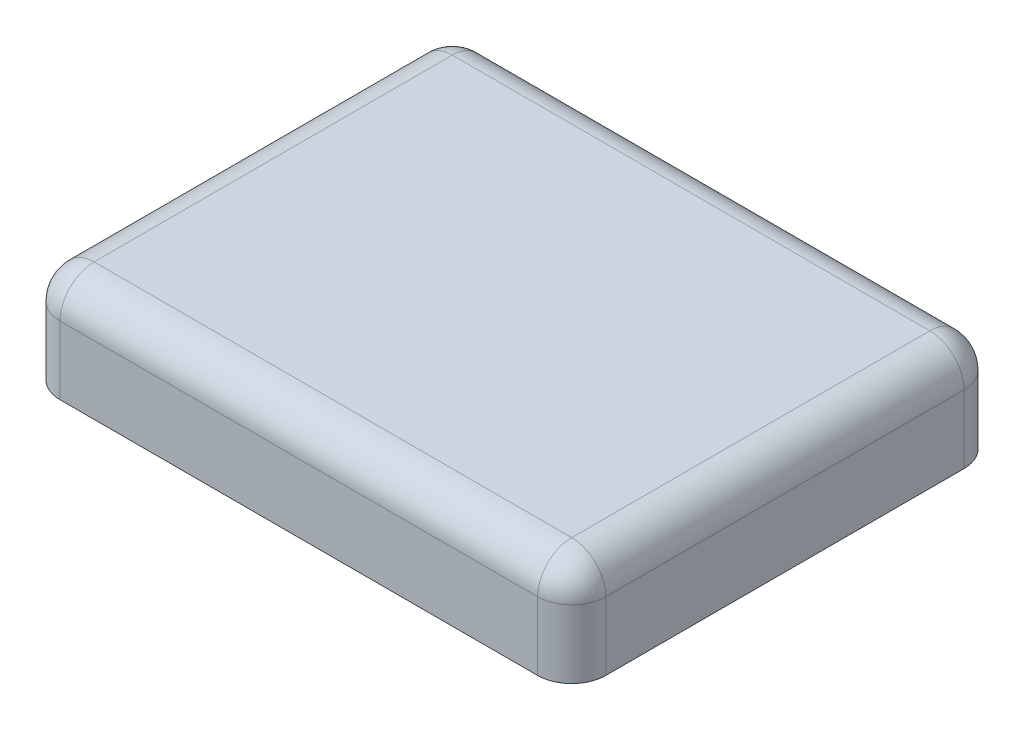
ISO-10303-21;
HEADER;
FILE_DESCRIPTION(('STEP AP214'),'2;1');
FILE_NAME('part.step','',(''),(''),'','','');
FILE_SCHEMA(('AUTOMOTIVE_DESIGN { 1 0 10303 214 1 1 1 1 }'));
ENDSEC;
DATA;
#1=APPLICATION_CONTEXT('core data for automotive mechanical design processes');
#2=APPLICATION_PROTOCOL_DEFINITION('international standard','automotive_design',2000,#1);
#3=PRODUCT_CONTEXT('',#1,'mechanical');
#4=PRODUCT('Part','Part','',(#3));
#5=PRODUCT_RELATED_PRODUCT_CATEGORY('part','',(#4));
#6=PRODUCT_DEFINITION_FORMATION('','',#4);
#7=PRODUCT_DEFINITION_CONTEXT('part definition',#1,'design');
#8=PRODUCT_DEFINITION('design','',#6,#7);
#9=PRODUCT_DEFINITION_SHAPE('','',#8);
#10=(LENGTH_UNIT() NAMED_UNIT(*) SI_UNIT(.MILLI.,.METRE.));
#11=(NAMED_UNIT(*) PLANE_ANGLE_UNIT() SI_UNIT($,.RADIAN.));
#12=(NAMED_UNIT(*) SI_UNIT($,.STERADIAN.) SOLID_ANGLE_UNIT());
#13=UNCERTAINTY_MEASURE_WITH_UNIT(LENGTH_MEASURE(1.E-05),#10,'distance_accuracy_value','');
#14=(GEOMETRIC_REPRESENTATION_CONTEXT(3) GLOBAL_UNCERTAINTY_ASSIGNED_CONTEXT((#13)) GLOBAL_UNIT_ASSIGNED_CONTEXT((#10,
#11,#12)) REPRESENTATION_CONTEXT('',''));
#15=CARTESIAN_POINT('',(0.,0.,0.));
#16=DIRECTION('',(0.,0.,1.));
#17=DIRECTION('',(1.,0.,0.));
#18=AXIS2_PLACEMENT_3D('',#15,#16,#17);
#19=CARTESIAN_POINT('',(1.6,0.6,-1.25));
#20=DIRECTION('',(-1.,0.,0.));
#21=DIRECTION('',(0.,0.,1.));
#22=AXIS2_PLACEMENT_3D('',#19,#20,#21);
#23=PLANE('',#22);
#24=DIRECTION('',(0.,-1.,0.));
#25=VECTOR('',#24,1.);
#26=CARTESIAN_POINT('',(1.6,0.6,-1.05));
#27=LINE('',#26,#25);
#28=CARTESIAN_POINT('',(1.6,0.,-1.05));
#29=VERTEX_POINT('',#28);
#30=CARTESIAN_POINT('',(1.6,0.4,-1.05));
#31=VERTEX_POINT('',#30);
#32=EDGE_CURVE('E120',#29,#31,#27,.F.);
#33=ORIENTED_EDGE('',*,*,#32,.T.);
#34=DIRECTION('',(0.,0.,-1.));
#35=VECTOR('',#34,1.);
#36=CARTESIAN_POINT('',(1.6,0.4,1.05));
#37=LINE('',#36,#35);
#38=CARTESIAN_POINT('',(1.6,0.4,1.05));
#39=VERTEX_POINT('',#38);
#40=EDGE_CURVE('E60',#31,#39,#37,.F.);
#41=ORIENTED_EDGE('',*,*,#40,.T.);
#42=DIRECTION('',(0.,-1.,0.));
#43=VECTOR('',#42,1.);
#44=CARTESIAN_POINT('',(1.6,0.6,1.05));
#45=LINE('',#44,#43);
#46=CARTESIAN_POINT('',(1.6,0.,1.05));
#47=VERTEX_POINT('',#46);
#48=EDGE_CURVE('E113',#39,#47,#45,.T.);
#49=ORIENTED_EDGE('',*,*,#48,.T.);
#50=DIRECTION('',(0.,0.,-1.));
#51=VECTOR('',#50,1.);
#52=CARTESIAN_POINT('',(1.6,0.,-1.25));
#53=LINE('',#52,#51);
#54=EDGE_CURVE('E116',#47,#29,#53,.T.);
#55=ORIENTED_EDGE('',*,*,#54,.T.);
#56=EDGE_LOOP('',(#33,#41,#49,#55));
#57=FACE_BOUND('',#56,.T.);
#58=ADVANCED_FACE('F36',(#57),#23,.F.);
#59=CARTESIAN_POINT('',(-1.6,0.6,-1.25));
#60=DIRECTION('',(0.,0.,1.));
#61=DIRECTION('',(1.,0.,0.));
#62=AXIS2_PLACEMENT_3D('',#59,#60,#61);
#63=PLANE('',#62);
#64=DIRECTION('',(0.,-1.,0.));
#65=VECTOR('',#64,1.);
#66=CARTESIAN_POINT('',(-1.4,0.6,-1.25));
#67=LINE('',#66,#65);
#68=CARTESIAN_POINT('',(-1.4,0.,-1.25));
#69=VERTEX_POINT('',#68);
#70=CARTESIAN_POINT('',(-1.4,0.4,-1.25));
#71=VERTEX_POINT('',#70);
#72=EDGE_CURVE('E153',#69,#71,#67,.F.);
#73=ORIENTED_EDGE('',*,*,#72,.T.);
#74=DIRECTION('',(-1.,0.,0.));
#75=VECTOR('',#74,1.);
#76=CARTESIAN_POINT('',(1.4,0.4,-1.25));
#77=LINE('',#76,#75);
#78=CARTESIAN_POINT('',(1.4,0.4,-1.25));
#79=VERTEX_POINT('',#78);
#80=EDGE_CURVE('E179',#71,#79,#77,.F.);
#81=ORIENTED_EDGE('',*,*,#80,.T.);
#82=DIRECTION('',(0.,-1.,0.));
#83=VECTOR('',#82,1.);
#84=CARTESIAN_POINT('',(1.4,0.6,-1.25));
#85=LINE('',#84,#83);
#86=CARTESIAN_POINT('',(1.4,0.,-1.25));
#87=VERTEX_POINT('',#86);
#88=EDGE_CURVE('E156',#79,#87,#85,.T.);
#89=ORIENTED_EDGE('',*,*,#88,.T.);
#90=DIRECTION('',(-1.,0.,0.));
#91=VECTOR('',#90,1.);
#92=CARTESIAN_POINT('',(-1.6,0.,-1.25));
#93=LINE('',#92,#91);
#94=EDGE_CURVE('E134',#87,#69,#93,.T.);
#95=ORIENTED_EDGE('',*,*,#94,.T.);
#96=EDGE_LOOP('',(#73,#81,#89,#95));
#97=FACE_BOUND('',#96,.T.);
#98=ADVANCED_FACE('F238',(#97),#63,.F.);
#99=CARTESIAN_POINT('',(-1.6,0.6,-1.25));
#100=DIRECTION('',(1.,0.,0.));
#101=DIRECTION('',(0.,0.,-1.));
#102=AXIS2_PLACEMENT_3D('',#99,#100,#101);
#103=PLANE('',#102);
#104=DIRECTION('',(0.,-1.,0.));
#105=VECTOR('',#104,1.);
#106=CARTESIAN_POINT('',(-1.6,0.6,1.05));
#107=LINE('',#106,#105);
#108=CARTESIAN_POINT('',(-1.6,0.,1.05));
#109=VERTEX_POINT('',#108);
#110=CARTESIAN_POINT('',(-1.6,0.4,1.05));
#111=VERTEX_POINT('',#110);
#112=EDGE_CURVE('E160',#109,#111,#107,.F.);
#113=ORIENTED_EDGE('',*,*,#112,.T.);
#114=DIRECTION('',(0.,0.,1.));
#115=VECTOR('',#114,1.);
#116=CARTESIAN_POINT('',(-1.6,0.4,-1.05));
#117=LINE('',#116,#115);
#118=CARTESIAN_POINT('',(-1.6,0.4,-1.05));
#119=VERTEX_POINT('',#118);
#120=EDGE_CURVE('E175',#111,#119,#117,.F.);
#121=ORIENTED_EDGE('',*,*,#120,.T.);
#122=DIRECTION('',(0.,-1.,0.));
#123=VECTOR('',#122,1.);
#124=CARTESIAN_POINT('',(-1.6,0.6,-1.05));
#125=LINE('',#124,#123);
#126=CARTESIAN_POINT('',(-1.6,0.,-1.05));
#127=VERTEX_POINT('',#126);
#128=EDGE_CURVE('E158',#119,#127,#125,.T.);
#129=ORIENTED_EDGE('',*,*,#128,.T.);
#130=DIRECTION('',(0.,0.,1.));
#131=VECTOR('',#130,1.);
#132=CARTESIAN_POINT('',(-1.6,0.,-1.25));
#133=LINE('',#132,#131);
#134=EDGE_CURVE('E137',#127,#109,#133,.T.);
#135=ORIENTED_EDGE('',*,*,#134,.T.);
#136=EDGE_LOOP('',(#113,#121,#129,#135));
#137=FACE_BOUND('',#136,.T.);
#138=ADVANCED_FACE('F243',(#137),#103,.F.);
#139=CARTESIAN_POINT('',(-1.6,0.6,1.25));
#140=DIRECTION('',(0.,0.,-1.));
#141=DIRECTION('',(-1.,0.,0.));
#142=AXIS2_PLACEMENT_3D('',#139,#140,#141);
#143=PLANE('',#142);
#144=DIRECTION('',(0.,-1.,0.));
#145=VECTOR('',#144,1.);
#146=CARTESIAN_POINT('',(1.4,0.6,1.25));
#147=LINE('',#146,#145);
#148=CARTESIAN_POINT('',(1.4,0.,1.25));
#149=VERTEX_POINT('',#148);
#150=CARTESIAN_POINT('',(1.4,0.4,1.25));
#151=VERTEX_POINT('',#150);
#152=EDGE_CURVE('E124',#149,#151,#147,.F.);
#153=ORIENTED_EDGE('',*,*,#152,.T.);
#154=DIRECTION('',(1.,0.,0.));
#155=VECTOR('',#154,1.);
#156=CARTESIAN_POINT('',(-1.4,0.4,1.25));
#157=LINE('',#156,#155);
#158=CARTESIAN_POINT('',(-1.4,0.4,1.25));
#159=VERTEX_POINT('',#158);
#160=EDGE_CURVE('E11',#151,#159,#157,.F.);
#161=ORIENTED_EDGE('',*,*,#160,.T.);
#162=DIRECTION('',(0.,-1.,0.));
#163=VECTOR('',#162,1.);
#164=CARTESIAN_POINT('',(-1.4,0.6,1.25));
#165=LINE('',#164,#163);
#166=CARTESIAN_POINT('',(-1.4,0.,1.25));
#167=VERTEX_POINT('',#166);
#168=EDGE_CURVE('E128',#159,#167,#165,.T.);
#169=ORIENTED_EDGE('',*,*,#168,.T.);
#170=DIRECTION('',(1.,0.,0.));
#171=VECTOR('',#170,1.);
#172=CARTESIAN_POINT('',(-1.6,0.,1.25));
#173=LINE('',#172,#171);
#174=EDGE_CURVE('E144',#167,#149,#173,.T.);
#175=ORIENTED_EDGE('',*,*,#174,.T.);
#176=EDGE_LOOP('',(#153,#161,#169,#175));
#177=FACE_BOUND('',#176,.T.);
#178=ADVANCED_FACE('F354',(#177),#143,.F.);
#179=CARTESIAN_POINT('',(0.,0.6,0.));
#180=DIRECTION('',(0.,1.,0.));
#181=DIRECTION('',(0.,0.,1.));
#182=AXIS2_PLACEMENT_3D('',#179,#180,#181);
#183=PLANE('',#182);
#184=DIRECTION('',(-1.,0.,0.));
#185=VECTOR('',#184,1.);
#186=CARTESIAN_POINT('',(-1.4,0.6,-1.05));
#187=LINE('',#186,#185);
#188=CARTESIAN_POINT('',(1.4,0.6,-1.05));
#189=VERTEX_POINT('',#188);
#190=CARTESIAN_POINT('',(-1.4,0.6,-1.05));
#191=VERTEX_POINT('',#190);
#192=EDGE_CURVE('E170',#189,#191,#187,.T.);
#193=ORIENTED_EDGE('',*,*,#192,.T.);
#194=DIRECTION('',(0.,0.,1.));
#195=VECTOR('',#194,1.);
#196=CARTESIAN_POINT('',(-1.4,0.6,1.05));
#197=LINE('',#196,#195);
#198=CARTESIAN_POINT('',(-1.4,0.6,1.05));
#199=VERTEX_POINT('',#198);
#200=EDGE_CURVE('E172',#191,#199,#197,.T.);
#201=ORIENTED_EDGE('',*,*,#200,.T.);
#202=DIRECTION('',(1.,0.,0.));
#203=VECTOR('',#202,1.);
#204=CARTESIAN_POINT('',(1.4,0.6,1.05));
#205=LINE('',#204,#203);
#206=CARTESIAN_POINT('',(1.4,0.6,1.05));
#207=VERTEX_POINT('',#206);
#208=EDGE_CURVE('E166',#199,#207,#205,.T.);
#209=ORIENTED_EDGE('',*,*,#208,.T.);
#210=DIRECTION('',(0.,0.,-1.));
#211=VECTOR('',#210,1.);
#212=CARTESIAN_POINT('',(1.4,0.6,-1.05));
#213=LINE('',#212,#211);
#214=EDGE_CURVE('E168',#207,#189,#213,.T.);
#215=ORIENTED_EDGE('',*,*,#214,.T.);
#216=EDGE_LOOP('',(#193,#201,#209,#215));
#217=FACE_BOUND('',#216,.T.);
#218=ADVANCED_FACE('F215',(#217),#183,.T.);
#219=CARTESIAN_POINT('',(0.,0.,0.));
#220=DIRECTION('',(0.,1.,0.));
#221=DIRECTION('',(0.,0.,1.));
#222=AXIS2_PLACEMENT_3D('',#219,#220,#221);
#223=PLANE('',#222);
#224=ORIENTED_EDGE('',*,*,#54,.F.);
#225=CARTESIAN_POINT('',(1.4,0.,1.05));
#226=DIRECTION('',(0.,1.,0.));
#227=DIRECTION('',(0.,0.,1.));
#228=AXIS2_PLACEMENT_3D('',#225,#226,#227);
#229=CIRCLE('',#228,0.2);
#230=EDGE_CURVE('E122',#47,#149,#229,.F.);
#231=ORIENTED_EDGE('',*,*,#230,.T.);
#232=ORIENTED_EDGE('',*,*,#174,.F.);
#233=CARTESIAN_POINT('',(-1.4,0.,1.05));
#234=DIRECTION('',(0.,1.,0.));
#235=DIRECTION('',(0.,0.,1.));
#236=AXIS2_PLACEMENT_3D('',#233,#234,#235);
#237=CIRCLE('',#236,0.2);
#238=EDGE_CURVE('E148',#167,#109,#237,.F.);
#239=ORIENTED_EDGE('',*,*,#238,.T.);
#240=ORIENTED_EDGE('',*,*,#134,.F.);
#241=CARTESIAN_POINT('',(-1.4,0.,-1.05));
#242=DIRECTION('',(0.,1.,0.));
#243=DIRECTION('',(0.,0.,1.));
#244=AXIS2_PLACEMENT_3D('',#241,#242,#243);
#245=CIRCLE('',#244,0.2);
#246=EDGE_CURVE('E119',#127,#69,#245,.F.);
#247=ORIENTED_EDGE('',*,*,#246,.T.);
#248=ORIENTED_EDGE('',*,*,#94,.F.);
#249=CARTESIAN_POINT('',(1.4,0.,-1.05));
#250=DIRECTION('',(0.,1.,0.));
#251=DIRECTION('',(0.,0.,1.));
#252=AXIS2_PLACEMENT_3D('',#249,#250,#251);
#253=CIRCLE('',#252,0.2);
#254=EDGE_CURVE('E129',#87,#29,#253,.F.);
#255=ORIENTED_EDGE('',*,*,#254,.T.);
#256=EDGE_LOOP('',(#224,#231,#232,#239,#240,#247,#248,#255));
#257=FACE_BOUND('',#256,.T.);
#258=ADVANCED_FACE('F131',(#257),#223,.F.);
#259=CARTESIAN_POINT('',(1.4,0.6,1.05));
#260=DIRECTION('',(0.,-1.,0.));
#261=DIRECTION('',(0.,0.,-1.));
#262=AXIS2_PLACEMENT_3D('',#259,#260,#261);
#263=CYLINDRICAL_SURFACE('',#262,0.2);
#264=ORIENTED_EDGE('',*,*,#48,.F.);
#265=CARTESIAN_POINT('',(1.4,0.4,1.05));
#266=DIRECTION('',(0.,-1.,0.));
#267=DIRECTION('',(0.,0.,-1.));
#268=AXIS2_PLACEMENT_3D('',#265,#266,#267);
#269=CIRCLE('',#268,0.2);
#270=EDGE_CURVE('E45',#39,#151,#269,.T.);
#271=ORIENTED_EDGE('',*,*,#270,.T.);
#272=ORIENTED_EDGE('',*,*,#152,.F.);
#273=ORIENTED_EDGE('',*,*,#230,.F.);
#274=EDGE_LOOP('',(#264,#271,#272,#273));
#275=FACE_BOUND('',#274,.T.);
#276=ADVANCED_FACE('F123',(#275),#263,.T.);
#277=CARTESIAN_POINT('',(1.4,0.6,-1.05));
#278=DIRECTION('',(0.,-1.,0.));
#279=DIRECTION('',(0.,0.,-1.));
#280=AXIS2_PLACEMENT_3D('',#277,#278,#279);
#281=CYLINDRICAL_SURFACE('',#280,0.2);
#282=ORIENTED_EDGE('',*,*,#88,.F.);
#283=CARTESIAN_POINT('',(1.4,0.4,-1.05));
#284=DIRECTION('',(0.,-1.,0.));
#285=DIRECTION('',(0.,0.,-1.));
#286=AXIS2_PLACEMENT_3D('',#283,#284,#285);
#287=CIRCLE('',#286,0.2);
#288=EDGE_CURVE('E181',#79,#31,#287,.T.);
#289=ORIENTED_EDGE('',*,*,#288,.T.);
#290=ORIENTED_EDGE('',*,*,#32,.F.);
#291=ORIENTED_EDGE('',*,*,#254,.F.);
#292=EDGE_LOOP('',(#282,#289,#290,#291));
#293=FACE_BOUND('',#292,.T.);
#294=ADVANCED_FACE('F250',(#293),#281,.T.);
#295=CARTESIAN_POINT('',(-1.4,0.6,1.05));
#296=DIRECTION('',(0.,-1.,0.));
#297=DIRECTION('',(0.,0.,-1.));
#298=AXIS2_PLACEMENT_3D('',#295,#296,#297);
#299=CYLINDRICAL_SURFACE('',#298,0.2);
#300=ORIENTED_EDGE('',*,*,#168,.F.);
#301=CARTESIAN_POINT('',(-1.4,0.4,1.05));
#302=DIRECTION('',(0.,-1.,0.));
#303=DIRECTION('',(0.,0.,-1.));
#304=AXIS2_PLACEMENT_3D('',#301,#302,#303);
#305=CIRCLE('',#304,0.2);
#306=EDGE_CURVE('E163',#159,#111,#305,.T.);
#307=ORIENTED_EDGE('',*,*,#306,.T.);
#308=ORIENTED_EDGE('',*,*,#112,.F.);
#309=ORIENTED_EDGE('',*,*,#238,.F.);
#310=EDGE_LOOP('',(#300,#307,#308,#309));
#311=FACE_BOUND('',#310,.T.);
#312=ADVANCED_FACE('F253',(#311),#299,.T.);
#313=CARTESIAN_POINT('',(-1.4,0.6,-1.05));
#314=DIRECTION('',(0.,-1.,0.));
#315=DIRECTION('',(0.,0.,-1.));
#316=AXIS2_PLACEMENT_3D('',#313,#314,#315);
#317=CYLINDRICAL_SURFACE('',#316,0.2);
#318=ORIENTED_EDGE('',*,*,#128,.F.);
#319=CARTESIAN_POINT('',(-1.4,0.4,-1.05));
#320=DIRECTION('',(0.,-1.,0.));
#321=DIRECTION('',(0.,0.,-1.));
#322=AXIS2_PLACEMENT_3D('',#319,#320,#321);
#323=CIRCLE('',#322,0.2);
#324=EDGE_CURVE('E177',#119,#71,#323,.T.);
#325=ORIENTED_EDGE('',*,*,#324,.T.);
#326=ORIENTED_EDGE('',*,*,#72,.F.);
#327=ORIENTED_EDGE('',*,*,#246,.F.);
#328=EDGE_LOOP('',(#318,#325,#326,#327));
#329=FACE_BOUND('',#328,.T.);
#330=ADVANCED_FACE('F257',(#329),#317,.T.);
#331=CARTESIAN_POINT('',(1.4,0.4,-1.05));
#332=DIRECTION('',(0.,1.,0.));
#333=DIRECTION('',(0.,0.,1.));
#334=AXIS2_PLACEMENT_3D('',#331,#332,#333);
#335=SPHERICAL_SURFACE('',#334,0.2);
#336=CARTESIAN_POINT('',(1.4,0.4,-1.05));
#337=DIRECTION('',(0.,0.,1.));
#338=DIRECTION('',(1.,0.,0.));
#339=AXIS2_PLACEMENT_3D('',#336,#337,#338);
#340=CIRCLE('',#339,0.2);
#341=EDGE_CURVE('E140',#31,#189,#340,.T.);
#342=ORIENTED_EDGE('',*,*,#341,.F.);
#343=ORIENTED_EDGE('',*,*,#288,.F.);
#344=CARTESIAN_POINT('',(1.4,0.4,-1.05));
#345=DIRECTION('',(-1.,0.,0.));
#346=DIRECTION('',(0.,0.,1.));
#347=AXIS2_PLACEMENT_3D('',#344,#345,#346);
#348=CIRCLE('',#347,0.2);
#349=EDGE_CURVE('E40',#189,#79,#348,.T.);
#350=ORIENTED_EDGE('',*,*,#349,.F.);
#351=EDGE_LOOP('',(#342,#343,#350));
#352=FACE_BOUND('',#351,.T.);
#353=ADVANCED_FACE('F38',(#352),#335,.T.);
#354=CARTESIAN_POINT('',(0.,0.4,-1.05));
#355=DIRECTION('',(1.,0.,0.));
#356=DIRECTION('',(0.,0.,-1.));
#357=AXIS2_PLACEMENT_3D('',#354,#355,#356);
#358=CYLINDRICAL_SURFACE('',#357,0.2);
#359=ORIENTED_EDGE('',*,*,#349,.T.);
#360=ORIENTED_EDGE('',*,*,#80,.F.);
#361=CARTESIAN_POINT('',(-1.4,0.4,-1.05));
#362=DIRECTION('',(-1.,0.,0.));
#363=DIRECTION('',(0.,0.,1.));
#364=AXIS2_PLACEMENT_3D('',#361,#362,#363);
#365=CIRCLE('',#364,0.2);
#366=EDGE_CURVE('E198',#191,#71,#365,.T.);
#367=ORIENTED_EDGE('',*,*,#366,.F.);
#368=ORIENTED_EDGE('',*,*,#192,.F.);
#369=EDGE_LOOP('',(#359,#360,#367,#368));
#370=FACE_BOUND('',#369,.T.);
#371=ADVANCED_FACE('F212',(#370),#358,.T.);
#372=CARTESIAN_POINT('',(1.4,0.4,0.));
#373=DIRECTION('',(0.,0.,1.));
#374=DIRECTION('',(1.,0.,0.));
#375=AXIS2_PLACEMENT_3D('',#372,#373,#374);
#376=CYLINDRICAL_SURFACE('',#375,0.2);
#377=ORIENTED_EDGE('',*,*,#341,.T.);
#378=ORIENTED_EDGE('',*,*,#214,.F.);
#379=CARTESIAN_POINT('',(1.4,0.4,1.05));
#380=DIRECTION('',(0.,0.,1.));
#381=DIRECTION('',(1.,0.,0.));
#382=AXIS2_PLACEMENT_3D('',#379,#380,#381);
#383=CIRCLE('',#382,0.2);
#384=EDGE_CURVE('E195',#39,#207,#383,.T.);
#385=ORIENTED_EDGE('',*,*,#384,.F.);
#386=ORIENTED_EDGE('',*,*,#40,.F.);
#387=EDGE_LOOP('',(#377,#378,#385,#386));
#388=FACE_BOUND('',#387,.T.);
#389=ADVANCED_FACE('F205',(#388),#376,.T.);
#390=CARTESIAN_POINT('',(-1.4,0.4,-1.05));
#391=DIRECTION('',(0.,1.,0.));
#392=DIRECTION('',(0.,0.,1.));
#393=AXIS2_PLACEMENT_3D('',#390,#391,#392);
#394=SPHERICAL_SURFACE('',#393,0.2);
#395=ORIENTED_EDGE('',*,*,#366,.T.);
#396=ORIENTED_EDGE('',*,*,#324,.F.);
#397=CARTESIAN_POINT('',(-1.4,0.4,-1.05));
#398=DIRECTION('',(0.,0.,1.));
#399=DIRECTION('',(1.,0.,0.));
#400=AXIS2_PLACEMENT_3D('',#397,#398,#399);
#401=CIRCLE('',#400,0.2);
#402=EDGE_CURVE('E192',#191,#119,#401,.T.);
#403=ORIENTED_EDGE('',*,*,#402,.F.);
#404=EDGE_LOOP('',(#395,#396,#403));
#405=FACE_BOUND('',#404,.T.);
#406=ADVANCED_FACE('F227',(#405),#394,.T.);
#407=CARTESIAN_POINT('',(1.4,0.4,1.05));
#408=DIRECTION('',(0.,1.,0.));
#409=DIRECTION('',(0.,0.,1.));
#410=AXIS2_PLACEMENT_3D('',#407,#408,#409);
#411=SPHERICAL_SURFACE('',#410,0.2);
#412=ORIENTED_EDGE('',*,*,#270,.F.);
#413=ORIENTED_EDGE('',*,*,#384,.T.);
#414=CARTESIAN_POINT('',(1.4,0.4,1.05));
#415=DIRECTION('',(-1.,0.,0.));
#416=DIRECTION('',(0.,0.,1.));
#417=AXIS2_PLACEMENT_3D('',#414,#415,#416);
#418=CIRCLE('',#417,0.2);
#419=EDGE_CURVE('E189',#151,#207,#418,.T.);
#420=ORIENTED_EDGE('',*,*,#419,.F.);
#421=EDGE_LOOP('',(#412,#413,#420));
#422=FACE_BOUND('',#421,.T.);
#423=ADVANCED_FACE('F224',(#422),#411,.T.);
#424=CARTESIAN_POINT('',(-1.4,0.4,0.));
#425=DIRECTION('',(0.,0.,-1.));
#426=DIRECTION('',(-1.,0.,0.));
#427=AXIS2_PLACEMENT_3D('',#424,#425,#426);
#428=CYLINDRICAL_SURFACE('',#427,0.2);
#429=ORIENTED_EDGE('',*,*,#402,.T.);
#430=ORIENTED_EDGE('',*,*,#120,.F.);
#431=CARTESIAN_POINT('',(-1.4,0.4,1.05));
#432=DIRECTION('',(0.,0.,1.));
#433=DIRECTION('',(1.,0.,0.));
#434=AXIS2_PLACEMENT_3D('',#431,#432,#433);
#435=CIRCLE('',#434,0.2);
#436=EDGE_CURVE('E187',#199,#111,#435,.T.);
#437=ORIENTED_EDGE('',*,*,#436,.F.);
#438=ORIENTED_EDGE('',*,*,#200,.F.);
#439=EDGE_LOOP('',(#429,#430,#437,#438));
#440=FACE_BOUND('',#439,.T.);
#441=ADVANCED_FACE('F226',(#440),#428,.T.);
#442=CARTESIAN_POINT('',(0.,0.4,1.05));
#443=DIRECTION('',(-1.,0.,0.));
#444=DIRECTION('',(0.,0.,1.));
#445=AXIS2_PLACEMENT_3D('',#442,#443,#444);
#446=CYLINDRICAL_SURFACE('',#445,0.2);
#447=ORIENTED_EDGE('',*,*,#419,.T.);
#448=ORIENTED_EDGE('',*,*,#208,.F.);
#449=CARTESIAN_POINT('',(-1.4,0.4,1.05));
#450=DIRECTION('',(-1.,0.,0.));
#451=DIRECTION('',(0.,0.,1.));
#452=AXIS2_PLACEMENT_3D('',#449,#450,#451);
#453=CIRCLE('',#452,0.2);
#454=EDGE_CURVE('E185',#159,#199,#453,.T.);
#455=ORIENTED_EDGE('',*,*,#454,.F.);
#456=ORIENTED_EDGE('',*,*,#160,.F.);
#457=EDGE_LOOP('',(#447,#448,#455,#456));
#458=FACE_BOUND('',#457,.T.);
#459=ADVANCED_FACE('F220',(#458),#446,.T.);
#460=CARTESIAN_POINT('',(-1.4,0.4,1.05));
#461=DIRECTION('',(0.,1.,0.));
#462=DIRECTION('',(0.,0.,1.));
#463=AXIS2_PLACEMENT_3D('',#460,#461,#462);
#464=SPHERICAL_SURFACE('',#463,0.2);
#465=ORIENTED_EDGE('',*,*,#436,.T.);
#466=ORIENTED_EDGE('',*,*,#306,.F.);
#467=ORIENTED_EDGE('',*,*,#454,.T.);
#468=EDGE_LOOP('',(#465,#466,#467));
#469=FACE_BOUND('',#468,.T.);
#470=ADVANCED_FACE('F262',(#469),#464,.T.);
#471=CLOSED_SHELL('',(#58,#98,#138,#178,#218,#258,#276,#294,#312,#330,#353,#371,#389,#406,#423,
#441,#459,#470));
#472=MANIFOLD_SOLID_BREP('B2',#471);
#473=ADVANCED_BREP_SHAPE_REPRESENTATION('',(#18,#472),#14);
#474=SHAPE_DEFINITION_REPRESENTATION(#9,#473);
ENDSEC;
END-ISO-10303-21;
